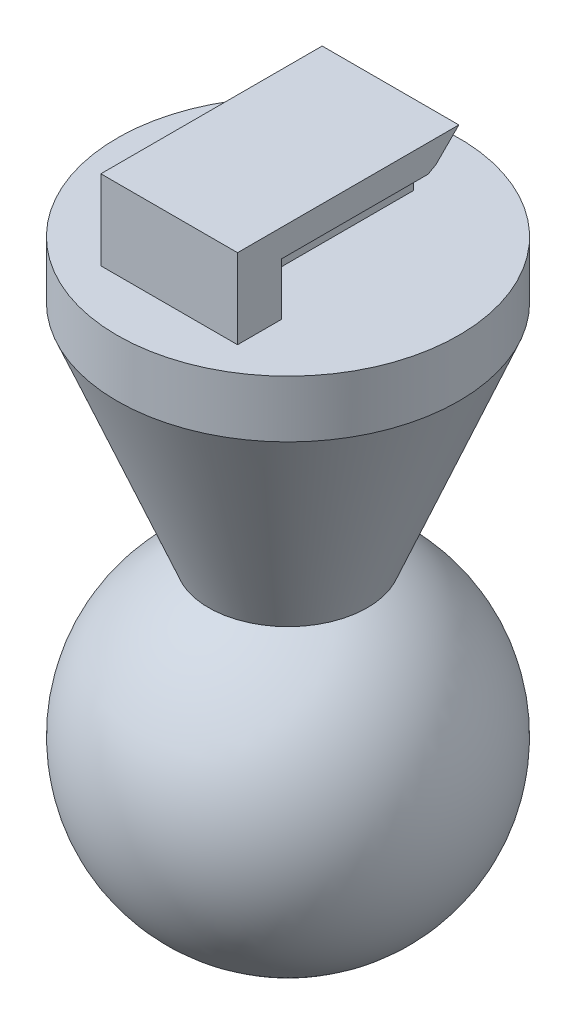
ISO-10303-21;
HEADER;
FILE_DESCRIPTION(('STEP AP214'),'2;1');
FILE_NAME('part.step','',(''),(''),'','','');
FILE_SCHEMA(('AUTOMOTIVE_DESIGN { 1 0 10303 214 1 1 1 1 }'));
ENDSEC;
DATA;
#1=APPLICATION_CONTEXT('core data for automotive mechanical design processes');
#2=APPLICATION_PROTOCOL_DEFINITION('international standard','automotive_design',2000,#1);
#3=PRODUCT_CONTEXT('',#1,'mechanical');
#4=PRODUCT('Part','Part','',(#3));
#5=PRODUCT_RELATED_PRODUCT_CATEGORY('part','',(#4));
#6=PRODUCT_DEFINITION_FORMATION('','',#4);
#7=PRODUCT_DEFINITION_CONTEXT('part definition',#1,'design');
#8=PRODUCT_DEFINITION('design','',#6,#7);
#9=PRODUCT_DEFINITION_SHAPE('','',#8);
#10=(LENGTH_UNIT() NAMED_UNIT(*) SI_UNIT(.MILLI.,.METRE.));
#11=(NAMED_UNIT(*) PLANE_ANGLE_UNIT() SI_UNIT($,.RADIAN.));
#12=(NAMED_UNIT(*) SI_UNIT($,.STERADIAN.) SOLID_ANGLE_UNIT());
#13=UNCERTAINTY_MEASURE_WITH_UNIT(LENGTH_MEASURE(1.E-05),#10,'distance_accuracy_value','');
#14=(GEOMETRIC_REPRESENTATION_CONTEXT(3) GLOBAL_UNCERTAINTY_ASSIGNED_CONTEXT((#13)) GLOBAL_UNIT_ASSIGNED_CONTEXT((#10,
#11,#12)) REPRESENTATION_CONTEXT('',''));
#15=CARTESIAN_POINT('',(0.,0.,0.));
#16=DIRECTION('',(0.,0.,1.));
#17=DIRECTION('',(1.,0.,0.));
#18=AXIS2_PLACEMENT_3D('',#15,#16,#17);
#19=CARTESIAN_POINT('',(0.,-2.,-4.5));
#20=DIRECTION('',(0.,1.,0.));
#21=DIRECTION('',(0.,0.,1.));
#22=AXIS2_PLACEMENT_3D('',#19,#20,#21);
#23=CYLINDRICAL_SURFACE('',#22,7.5);
#24=CARTESIAN_POINT('',(0.,-2.,-4.5));
#25=DIRECTION('',(0.,-1.,0.));
#26=DIRECTION('',(0.,0.,-1.));
#27=AXIS2_PLACEMENT_3D('',#24,#25,#26);
#28=CIRCLE('',#27,7.5);
#29=CARTESIAN_POINT('',(0.,-2.00000000000001,-12.));
#30=VERTEX_POINT('',#29);
#31=EDGE_CURVE('E187',#30,#30,#28,.T.);
#32=ORIENTED_EDGE('',*,*,#31,.F.);
#33=EDGE_LOOP('',(#32));
#34=FACE_BOUND('',#33,.T.);
#35=CARTESIAN_POINT('',(0.,0.499999999999997,-4.5));
#36=DIRECTION('',(0.,1.,0.));
#37=DIRECTION('',(0.,0.,1.));
#38=AXIS2_PLACEMENT_3D('',#35,#36,#37);
#39=CIRCLE('',#38,7.5);
#40=CARTESIAN_POINT('',(0.,0.500000000000002,3.));
#41=VERTEX_POINT('',#40);
#42=EDGE_CURVE('E140',#41,#41,#39,.T.);
#43=ORIENTED_EDGE('',*,*,#42,.F.);
#44=EDGE_LOOP('',(#43));
#45=FACE_BOUND('',#44,.T.);
#46=ADVANCED_FACE('F33',(#34,#45),#23,.T.);
#47=CARTESIAN_POINT('',(0.,-2.,-4.5));
#48=DIRECTION('',(0.,1.,0.));
#49=DIRECTION('',(0.,0.,1.));
#50=AXIS2_PLACEMENT_3D('',#47,#48,#49);
#51=CONICAL_SURFACE('',#50,7.5,0.386402431206859);
#52=CARTESIAN_POINT('',(0.,-11.8605308430168,-4.5));
#53=DIRECTION('',(0.,-1.,0.));
#54=DIRECTION('',(0.,0.,-1.));
#55=AXIS2_PLACEMENT_3D('',#52,#53,#54);
#56=CIRCLE('',#55,3.48818710987083);
#57=CARTESIAN_POINT('',(0.,-11.8605308430168,-7.98818710987083));
#58=VERTEX_POINT('',#57);
#59=EDGE_CURVE('E186',#58,#58,#56,.F.);
#60=ORIENTED_EDGE('',*,*,#59,.T.);
#61=EDGE_LOOP('',(#60));
#62=FACE_BOUND('',#61,.T.);
#63=ORIENTED_EDGE('',*,*,#31,.T.);
#64=EDGE_LOOP('',(#63));
#65=FACE_BOUND('',#64,.T.);
#66=ADVANCED_FACE('F266',(#62,#65),#51,.T.);
#67=CARTESIAN_POINT('',(0.,-18.5,-4.5));
#68=DIRECTION('',(0.,1.,0.));
#69=DIRECTION('',(0.,0.,-1.));
#70=AXIS2_PLACEMENT_3D('',#67,#68,#69);
#71=SPHERICAL_SURFACE('',#70,7.5);
#72=ORIENTED_EDGE('',*,*,#59,.F.);
#73=EDGE_LOOP('',(#72));
#74=FACE_BOUND('',#73,.T.);
#75=ADVANCED_FACE('F274',(#74),#71,.T.);
#76=CARTESIAN_POINT('',(0.,0.499999999999997,-4.5));
#77=DIRECTION('',(0.,1.,0.));
#78=DIRECTION('',(0.,0.,1.));
#79=AXIS2_PLACEMENT_3D('',#76,#77,#78);
#80=PLANE('',#79);
#81=ORIENTED_EDGE('',*,*,#42,.T.);
#82=EDGE_LOOP('',(#81));
#83=FACE_BOUND('',#82,.T.);
#84=DIRECTION('',(-1.,0.,0.));
#85=VECTOR('',#84,1.);
#86=CARTESIAN_POINT('',(1.,0.499999999999994,-9.));
#87=LINE('',#86,#85);
#88=CARTESIAN_POINT('',(1.,0.499999999999994,-9.));
#89=VERTEX_POINT('',#88);
#90=CARTESIAN_POINT('',(-1.,0.499999999999994,-9.));
#91=VERTEX_POINT('',#90);
#92=EDGE_CURVE('E146',#89,#91,#87,.T.);
#93=ORIENTED_EDGE('',*,*,#92,.F.);
#94=DIRECTION('',(0.,0.,-1.));
#95=VECTOR('',#94,1.);
#96=CARTESIAN_POINT('',(1.,0.5,0.));
#97=LINE('',#96,#95);
#98=CARTESIAN_POINT('',(1.,0.499999999999999,-1.20445497286554));
#99=VERTEX_POINT('',#98);
#100=EDGE_CURVE('E151',#99,#89,#97,.T.);
#101=ORIENTED_EDGE('',*,*,#100,.F.);
#102=DIRECTION('',(-1.,0.,0.));
#103=VECTOR('',#102,1.);
#104=CARTESIAN_POINT('',(10.6157731058639,0.499999999999999,-1.20445497286554));
#105=LINE('',#104,#103);
#106=CARTESIAN_POINT('',(3.,0.499999999999999,-1.20445497286554));
#107=VERTEX_POINT('',#106);
#108=EDGE_CURVE('E258',#107,#99,#105,.T.);
#109=ORIENTED_EDGE('',*,*,#108,.F.);
#110=DIRECTION('',(0.,0.,-1.));
#111=VECTOR('',#110,1.);
#112=CARTESIAN_POINT('',(3.,0.5,0.));
#113=LINE('',#112,#111);
#114=CARTESIAN_POINT('',(3.,0.5,0.714919666854875));
#115=VERTEX_POINT('',#114);
#116=EDGE_CURVE('E48',#115,#107,#113,.T.);
#117=ORIENTED_EDGE('',*,*,#116,.F.);
#118=DIRECTION('',(1.,0.,0.));
#119=VECTOR('',#118,1.);
#120=CARTESIAN_POINT('',(10.6157731058639,0.5,0.714919666854875));
#121=LINE('',#120,#119);
#122=CARTESIAN_POINT('',(-3.,0.5,0.714919666854875));
#123=VERTEX_POINT('',#122);
#124=EDGE_CURVE('E11',#123,#115,#121,.T.);
#125=ORIENTED_EDGE('',*,*,#124,.F.);
#126=DIRECTION('',(0.,0.,-1.));
#127=VECTOR('',#126,1.);
#128=CARTESIAN_POINT('',(-3.,0.5,0.));
#129=LINE('',#128,#127);
#130=CARTESIAN_POINT('',(-3.,0.499999999999999,-1.20445497286554));
#131=VERTEX_POINT('',#130);
#132=EDGE_CURVE('E127',#123,#131,#129,.T.);
#133=ORIENTED_EDGE('',*,*,#132,.T.);
#134=DIRECTION('',(-1.,0.,0.));
#135=VECTOR('',#134,1.);
#136=CARTESIAN_POINT('',(10.6157731058639,0.499999999999999,-1.20445497286554));
#137=LINE('',#136,#135);
#138=CARTESIAN_POINT('',(-1.,0.499999999999999,-1.20445497286554));
#139=VERTEX_POINT('',#138);
#140=EDGE_CURVE('E254',#139,#131,#137,.T.);
#141=ORIENTED_EDGE('',*,*,#140,.F.);
#142=DIRECTION('',(0.,0.,-1.));
#143=VECTOR('',#142,1.);
#144=CARTESIAN_POINT('',(-1.,0.5,0.));
#145=LINE('',#144,#143);
#146=EDGE_CURVE('E253',#139,#91,#145,.T.);
#147=ORIENTED_EDGE('',*,*,#146,.T.);
#148=EDGE_LOOP('',(#93,#101,#109,#117,#125,#133,#141,#147));
#149=FACE_BOUND('',#148,.T.);
#150=ADVANCED_FACE('F126',(#83,#149),#80,.T.);
#151=CARTESIAN_POINT('',(3.,4.,-9.));
#152=DIRECTION('',(0.,0.707106781186551,0.707106781186544));
#153=DIRECTION('',(0.,-0.707106781186544,0.707106781186551));
#154=AXIS2_PLACEMENT_3D('',#151,#152,#153);
#155=PLANE('',#154);
#156=DIRECTION('',(0.,-0.707106781186544,0.707106781186551));
#157=VECTOR('',#156,1.);
#158=CARTESIAN_POINT('',(1.,4.,-9.));
#159=LINE('',#158,#157);
#160=CARTESIAN_POINT('',(1.,4.,-9.));
#161=VERTEX_POINT('',#160);
#162=CARTESIAN_POINT('',(1.,3.,-7.99999999999999));
#163=VERTEX_POINT('',#162);
#164=EDGE_CURVE('E200',#161,#163,#159,.T.);
#165=ORIENTED_EDGE('',*,*,#164,.F.);
#166=DIRECTION('',(-1.,0.,0.));
#167=VECTOR('',#166,1.);
#168=CARTESIAN_POINT('',(3.,4.,-9.));
#169=LINE('',#168,#167);
#170=CARTESIAN_POINT('',(3.,4.,-9.));
#171=VERTEX_POINT('',#170);
#172=EDGE_CURVE('E213',#171,#161,#169,.T.);
#173=ORIENTED_EDGE('',*,*,#172,.F.);
#174=DIRECTION('',(0.,0.707106781186544,-0.707106781186551));
#175=VECTOR('',#174,1.);
#176=CARTESIAN_POINT('',(3.,4.,-9.));
#177=LINE('',#176,#175);
#178=CARTESIAN_POINT('',(3.,3.,-7.99999999999999));
#179=VERTEX_POINT('',#178);
#180=EDGE_CURVE('E203',#179,#171,#177,.T.);
#181=ORIENTED_EDGE('',*,*,#180,.F.);
#182=DIRECTION('',(-1.,0.,0.));
#183=VECTOR('',#182,1.);
#184=CARTESIAN_POINT('',(3.,3.,-7.99999999999999));
#185=LINE('',#184,#183);
#186=EDGE_CURVE('E217',#179,#163,#185,.T.);
#187=ORIENTED_EDGE('',*,*,#186,.T.);
#188=EDGE_LOOP('',(#165,#173,#181,#187));
#189=FACE_BOUND('',#188,.T.);
#190=ADVANCED_FACE('F247',(#189),#155,.F.);
#191=CARTESIAN_POINT('',(10.6157731058639,3.,-7.99999999999999));
#192=DIRECTION('',(0.,0.866357373985093,0.499424569421304));
#193=DIRECTION('',(0.,-0.499424569421304,0.866357373985093));
#194=AXIS2_PLACEMENT_3D('',#191,#192,#193);
#195=PLANE('',#194);
#196=DIRECTION('',(-1.,0.,0.));
#197=VECTOR('',#196,1.);
#198=CARTESIAN_POINT('',(10.6157731058639,2.8,-7.65305776806736));
#199=LINE('',#198,#197);
#200=CARTESIAN_POINT('',(3.,2.8,-7.65305776806736));
#201=VERTEX_POINT('',#200);
#202=CARTESIAN_POINT('',(1.,2.8,-7.65305776806736));
#203=VERTEX_POINT('',#202);
#204=EDGE_CURVE('E171',#201,#203,#199,.T.);
#205=ORIENTED_EDGE('',*,*,#204,.T.);
#206=DIRECTION('',(0.,0.499424569421304,-0.866357373985093));
#207=VECTOR('',#206,1.);
#208=CARTESIAN_POINT('',(1.,-1.20971596936477,-0.697358728930805));
#209=LINE('',#208,#207);
#210=EDGE_CURVE('E55',#203,#163,#209,.T.);
#211=ORIENTED_EDGE('',*,*,#210,.T.);
#212=ORIENTED_EDGE('',*,*,#186,.F.);
#213=DIRECTION('',(0.,-0.499424569421304,0.866357373985093));
#214=VECTOR('',#213,1.);
#215=CARTESIAN_POINT('',(3.,3.,-7.99999999999999));
#216=LINE('',#215,#214);
#217=EDGE_CURVE('E167',#179,#201,#216,.T.);
#218=ORIENTED_EDGE('',*,*,#217,.T.);
#219=EDGE_LOOP('',(#205,#211,#212,#218));
#220=FACE_BOUND('',#219,.T.);
#221=ADVANCED_FACE('F326',(#220),#195,.F.);
#222=DIRECTION('',(0.,0.499424569421304,-0.866357373985093));
#223=VECTOR('',#222,1.);
#224=CARTESIAN_POINT('',(-1.,-1.20971596936477,-0.697358728930805));
#225=LINE('',#224,#223);
#226=CARTESIAN_POINT('',(-1.,2.8,-7.65305776806736));
#227=VERTEX_POINT('',#226);
#228=CARTESIAN_POINT('',(-1.,3.,-7.99999999999999));
#229=VERTEX_POINT('',#228);
#230=EDGE_CURVE('E41',#227,#229,#225,.T.);
#231=ORIENTED_EDGE('',*,*,#230,.F.);
#232=CARTESIAN_POINT('',(-3.,2.8,-7.65305776806736));
#233=VERTEX_POINT('',#232);
#234=EDGE_CURVE('E162',#227,#233,#199,.T.);
#235=ORIENTED_EDGE('',*,*,#234,.T.);
#236=DIRECTION('',(0.,0.499424569421304,-0.866357373985092));
#237=VECTOR('',#236,1.);
#238=CARTESIAN_POINT('',(-3.,3.,-7.99999999999999));
#239=LINE('',#238,#237);
#240=CARTESIAN_POINT('',(-3.,3.,-7.99999999999999));
#241=VERTEX_POINT('',#240);
#242=EDGE_CURVE('E160',#233,#241,#239,.T.);
#243=ORIENTED_EDGE('',*,*,#242,.T.);
#244=EDGE_CURVE('E216',#229,#241,#185,.T.);
#245=ORIENTED_EDGE('',*,*,#244,.F.);
#246=EDGE_LOOP('',(#231,#235,#243,#245));
#247=FACE_BOUND('',#246,.T.);
#248=ADVANCED_FACE('F310',(#247),#195,.F.);
#249=CARTESIAN_POINT('',(-1.,4.,-9.));
#250=VERTEX_POINT('',#249);
#251=CARTESIAN_POINT('',(-3.,4.,-9.));
#252=VERTEX_POINT('',#251);
#253=EDGE_CURVE('E209',#250,#252,#169,.T.);
#254=ORIENTED_EDGE('',*,*,#253,.F.);
#255=DIRECTION('',(0.,-0.707106781186544,0.707106781186551));
#256=VECTOR('',#255,1.);
#257=CARTESIAN_POINT('',(-1.,4.,-9.));
#258=LINE('',#257,#256);
#259=EDGE_CURVE('E197',#250,#229,#258,.T.);
#260=ORIENTED_EDGE('',*,*,#259,.T.);
#261=ORIENTED_EDGE('',*,*,#244,.T.);
#262=DIRECTION('',(0.,0.707106781186544,-0.707106781186551));
#263=VECTOR('',#262,1.);
#264=CARTESIAN_POINT('',(-3.,4.,-9.));
#265=LINE('',#264,#263);
#266=EDGE_CURVE('E202',#241,#252,#265,.T.);
#267=ORIENTED_EDGE('',*,*,#266,.T.);
#268=EDGE_LOOP('',(#254,#260,#261,#267));
#269=FACE_BOUND('',#268,.T.);
#270=ADVANCED_FACE('F35',(#269),#155,.F.);
#271=CARTESIAN_POINT('',(10.6157731058639,2.8,-7.65305776806736));
#272=DIRECTION('',(0.,1.,0.));
#273=DIRECTION('',(0.,0.,1.));
#274=AXIS2_PLACEMENT_3D('',#271,#272,#273);
#275=PLANE('',#274);
#276=DIRECTION('',(0.,0.,-1.));
#277=VECTOR('',#276,1.);
#278=CARTESIAN_POINT('',(-1.,2.8,0.));
#279=LINE('',#278,#277);
#280=CARTESIAN_POINT('',(-1.,2.8,-1.20445497286554));
#281=VERTEX_POINT('',#280);
#282=EDGE_CURVE('E220',#281,#227,#279,.T.);
#283=ORIENTED_EDGE('',*,*,#282,.F.);
#284=DIRECTION('',(-1.,0.,0.));
#285=VECTOR('',#284,1.);
#286=CARTESIAN_POINT('',(10.6157731058639,2.8,-1.20445497286554));
#287=LINE('',#286,#285);
#288=CARTESIAN_POINT('',(-3.,2.8,-1.20445497286554));
#289=VERTEX_POINT('',#288);
#290=EDGE_CURVE('E174',#281,#289,#287,.T.);
#291=ORIENTED_EDGE('',*,*,#290,.T.);
#292=DIRECTION('',(0.,0.,-1.));
#293=VECTOR('',#292,1.);
#294=CARTESIAN_POINT('',(-3.,2.8,-7.65305776806736));
#295=LINE('',#294,#293);
#296=EDGE_CURVE('E157',#289,#233,#295,.T.);
#297=ORIENTED_EDGE('',*,*,#296,.T.);
#298=ORIENTED_EDGE('',*,*,#234,.F.);
#299=EDGE_LOOP('',(#283,#291,#297,#298));
#300=FACE_BOUND('',#299,.T.);
#301=ADVANCED_FACE('F299',(#300),#275,.F.);
#302=CARTESIAN_POINT('',(3.,2.8,-1.20445497286554));
#303=VERTEX_POINT('',#302);
#304=CARTESIAN_POINT('',(1.,2.8,-1.20445497286554));
#305=VERTEX_POINT('',#304);
#306=EDGE_CURVE('E175',#303,#305,#287,.T.);
#307=ORIENTED_EDGE('',*,*,#306,.T.);
#308=DIRECTION('',(0.,0.,-1.));
#309=VECTOR('',#308,1.);
#310=CARTESIAN_POINT('',(1.,2.8,0.));
#311=LINE('',#310,#309);
#312=EDGE_CURVE('E183',#305,#203,#311,.T.);
#313=ORIENTED_EDGE('',*,*,#312,.T.);
#314=ORIENTED_EDGE('',*,*,#204,.F.);
#315=DIRECTION('',(0.,0.,1.));
#316=VECTOR('',#315,1.);
#317=CARTESIAN_POINT('',(3.,2.8,-7.65305776806736));
#318=LINE('',#317,#316);
#319=EDGE_CURVE('E163',#201,#303,#318,.T.);
#320=ORIENTED_EDGE('',*,*,#319,.T.);
#321=EDGE_LOOP('',(#307,#313,#314,#320));
#322=FACE_BOUND('',#321,.T.);
#323=ADVANCED_FACE('F293',(#322),#275,.F.);
#324=CARTESIAN_POINT('',(3.,4.,0.));
#325=DIRECTION('',(0.,-1.,0.));
#326=DIRECTION('',(0.,0.,-1.));
#327=AXIS2_PLACEMENT_3D('',#324,#325,#326);
#328=PLANE('',#327);
#329=DIRECTION('',(0.,0.,1.));
#330=VECTOR('',#329,1.);
#331=CARTESIAN_POINT('',(-3.,4.,0.));
#332=LINE('',#331,#330);
#333=CARTESIAN_POINT('',(-3.,4.,0.714919666854875));
#334=VERTEX_POINT('',#333);
#335=EDGE_CURVE('E206',#252,#334,#332,.T.);
#336=ORIENTED_EDGE('',*,*,#335,.T.);
#337=DIRECTION('',(-1.,0.,0.));
#338=VECTOR('',#337,1.);
#339=CARTESIAN_POINT('',(10.6157731058639,4.,0.714919666854875));
#340=LINE('',#339,#338);
#341=CARTESIAN_POINT('',(3.,4.,0.714919666854875));
#342=VERTEX_POINT('',#341);
#343=EDGE_CURVE('E145',#342,#334,#340,.T.);
#344=ORIENTED_EDGE('',*,*,#343,.F.);
#345=DIRECTION('',(0.,0.,1.));
#346=VECTOR('',#345,1.);
#347=CARTESIAN_POINT('',(3.,4.,0.));
#348=LINE('',#347,#346);
#349=EDGE_CURVE('E205',#171,#342,#348,.T.);
#350=ORIENTED_EDGE('',*,*,#349,.F.);
#351=ORIENTED_EDGE('',*,*,#172,.T.);
#352=DIRECTION('',(-1.,0.,0.));
#353=VECTOR('',#352,1.);
#354=CARTESIAN_POINT('',(1.,4.,-9.));
#355=LINE('',#354,#353);
#356=EDGE_CURVE('E193',#161,#250,#355,.T.);
#357=ORIENTED_EDGE('',*,*,#356,.T.);
#358=ORIENTED_EDGE('',*,*,#253,.T.);
#359=EDGE_LOOP('',(#336,#344,#350,#351,#357,#358));
#360=FACE_BOUND('',#359,.T.);
#361=ADVANCED_FACE('F239',(#360),#328,.F.);
#362=CARTESIAN_POINT('',(1.,4.,-9.));
#363=DIRECTION('',(0.,0.,1.));
#364=DIRECTION('',(1.,0.,0.));
#365=AXIS2_PLACEMENT_3D('',#362,#363,#364);
#366=PLANE('',#365);
#367=DIRECTION('',(0.,1.,0.));
#368=VECTOR('',#367,1.);
#369=CARTESIAN_POINT('',(1.,4.,-9.));
#370=LINE('',#369,#368);
#371=EDGE_CURVE('E191',#89,#161,#370,.T.);
#372=ORIENTED_EDGE('',*,*,#371,.F.);
#373=ORIENTED_EDGE('',*,*,#92,.T.);
#374=DIRECTION('',(0.,1.,0.));
#375=VECTOR('',#374,1.);
#376=CARTESIAN_POINT('',(-1.,4.,-9.));
#377=LINE('',#376,#375);
#378=EDGE_CURVE('E190',#91,#250,#377,.T.);
#379=ORIENTED_EDGE('',*,*,#378,.T.);
#380=ORIENTED_EDGE('',*,*,#356,.F.);
#381=EDGE_LOOP('',(#372,#373,#379,#380));
#382=FACE_BOUND('',#381,.T.);
#383=ADVANCED_FACE('F245',(#382),#366,.F.);
#384=CARTESIAN_POINT('',(10.6157731058639,2.8,-1.20445497286554));
#385=DIRECTION('',(0.,0.,1.));
#386=DIRECTION('',(0.,-1.,0.));
#387=AXIS2_PLACEMENT_3D('',#384,#385,#386);
#388=PLANE('',#387);
#389=DIRECTION('',(0.,-1.,0.));
#390=VECTOR('',#389,1.);
#391=CARTESIAN_POINT('',(3.,2.8,-1.20445497286554));
#392=LINE('',#391,#390);
#393=EDGE_CURVE('E166',#303,#107,#392,.T.);
#394=ORIENTED_EDGE('',*,*,#393,.T.);
#395=ORIENTED_EDGE('',*,*,#108,.T.);
#396=DIRECTION('',(0.,1.,0.));
#397=VECTOR('',#396,1.);
#398=CARTESIAN_POINT('',(1.,0.,-1.20445497286554));
#399=LINE('',#398,#397);
#400=EDGE_CURVE('E181',#99,#305,#399,.T.);
#401=ORIENTED_EDGE('',*,*,#400,.T.);
#402=ORIENTED_EDGE('',*,*,#306,.F.);
#403=EDGE_LOOP('',(#394,#395,#401,#402));
#404=FACE_BOUND('',#403,.T.);
#405=ADVANCED_FACE('F287',(#404),#388,.F.);
#406=DIRECTION('',(0.,1.,0.));
#407=VECTOR('',#406,1.);
#408=CARTESIAN_POINT('',(-1.,0.,-1.20445497286554));
#409=LINE('',#408,#407);
#410=EDGE_CURVE('E170',#139,#281,#409,.T.);
#411=ORIENTED_EDGE('',*,*,#410,.F.);
#412=ORIENTED_EDGE('',*,*,#140,.T.);
#413=DIRECTION('',(0.,1.,0.));
#414=VECTOR('',#413,1.);
#415=CARTESIAN_POINT('',(-3.,2.8,-1.20445497286554));
#416=LINE('',#415,#414);
#417=EDGE_CURVE('E139',#131,#289,#416,.T.);
#418=ORIENTED_EDGE('',*,*,#417,.T.);
#419=ORIENTED_EDGE('',*,*,#290,.F.);
#420=EDGE_LOOP('',(#411,#412,#418,#419));
#421=FACE_BOUND('',#420,.T.);
#422=ADVANCED_FACE('F312',(#421),#388,.F.);
#423=CARTESIAN_POINT('',(10.6157731058639,4.,0.714919666854875));
#424=DIRECTION('',(0.,0.,-1.));
#425=DIRECTION('',(-1.,0.,0.));
#426=AXIS2_PLACEMENT_3D('',#423,#424,#425);
#427=PLANE('',#426);
#428=DIRECTION('',(0.,-1.,0.));
#429=VECTOR('',#428,1.);
#430=CARTESIAN_POINT('',(-3.,4.,0.714919666854875));
#431=LINE('',#430,#429);
#432=EDGE_CURVE('E137',#334,#123,#431,.T.);
#433=ORIENTED_EDGE('',*,*,#432,.T.);
#434=ORIENTED_EDGE('',*,*,#124,.T.);
#435=DIRECTION('',(0.,1.,0.));
#436=VECTOR('',#435,1.);
#437=CARTESIAN_POINT('',(3.,4.,0.714919666854875));
#438=LINE('',#437,#436);
#439=EDGE_CURVE('E148',#115,#342,#438,.T.);
#440=ORIENTED_EDGE('',*,*,#439,.T.);
#441=ORIENTED_EDGE('',*,*,#343,.T.);
#442=EDGE_LOOP('',(#433,#434,#440,#441));
#443=FACE_BOUND('',#442,.T.);
#444=ADVANCED_FACE('F143',(#443),#427,.F.);
#445=CARTESIAN_POINT('',(-3.,0.,0.));
#446=DIRECTION('',(-1.,0.,0.));
#447=DIRECTION('',(0.,0.,1.));
#448=AXIS2_PLACEMENT_3D('',#445,#446,#447);
#449=PLANE('',#448);
#450=ORIENTED_EDGE('',*,*,#132,.F.);
#451=ORIENTED_EDGE('',*,*,#432,.F.);
#452=ORIENTED_EDGE('',*,*,#335,.F.);
#453=ORIENTED_EDGE('',*,*,#266,.F.);
#454=ORIENTED_EDGE('',*,*,#242,.F.);
#455=ORIENTED_EDGE('',*,*,#296,.F.);
#456=ORIENTED_EDGE('',*,*,#417,.F.);
#457=EDGE_LOOP('',(#450,#451,#452,#453,#454,#455,#456));
#458=FACE_BOUND('',#457,.T.);
#459=ADVANCED_FACE('F135',(#458),#449,.T.);
#460=CARTESIAN_POINT('',(3.,0.,0.));
#461=DIRECTION('',(-1.,0.,0.));
#462=DIRECTION('',(0.,0.,1.));
#463=AXIS2_PLACEMENT_3D('',#460,#461,#462);
#464=PLANE('',#463);
#465=ORIENTED_EDGE('',*,*,#439,.F.);
#466=ORIENTED_EDGE('',*,*,#116,.T.);
#467=ORIENTED_EDGE('',*,*,#393,.F.);
#468=ORIENTED_EDGE('',*,*,#319,.F.);
#469=ORIENTED_EDGE('',*,*,#217,.F.);
#470=ORIENTED_EDGE('',*,*,#180,.T.);
#471=ORIENTED_EDGE('',*,*,#349,.T.);
#472=EDGE_LOOP('',(#465,#466,#467,#468,#469,#470,#471));
#473=FACE_BOUND('',#472,.T.);
#474=ADVANCED_FACE('F284',(#473),#464,.F.);
#475=CARTESIAN_POINT('',(-1.,0.,0.));
#476=DIRECTION('',(-1.,0.,0.));
#477=DIRECTION('',(0.,0.,1.));
#478=AXIS2_PLACEMENT_3D('',#475,#476,#477);
#479=PLANE('',#478);
#480=ORIENTED_EDGE('',*,*,#146,.F.);
#481=ORIENTED_EDGE('',*,*,#410,.T.);
#482=ORIENTED_EDGE('',*,*,#282,.T.);
#483=ORIENTED_EDGE('',*,*,#230,.T.);
#484=ORIENTED_EDGE('',*,*,#259,.F.);
#485=ORIENTED_EDGE('',*,*,#378,.F.);
#486=EDGE_LOOP('',(#480,#481,#482,#483,#484,#485));
#487=FACE_BOUND('',#486,.T.);
#488=ADVANCED_FACE('F228',(#487),#479,.T.);
#489=CARTESIAN_POINT('',(1.,0.,0.));
#490=DIRECTION('',(-1.,0.,0.));
#491=DIRECTION('',(0.,0.,1.));
#492=AXIS2_PLACEMENT_3D('',#489,#490,#491);
#493=PLANE('',#492);
#494=ORIENTED_EDGE('',*,*,#400,.F.);
#495=ORIENTED_EDGE('',*,*,#100,.T.);
#496=ORIENTED_EDGE('',*,*,#371,.T.);
#497=ORIENTED_EDGE('',*,*,#164,.T.);
#498=ORIENTED_EDGE('',*,*,#210,.F.);
#499=ORIENTED_EDGE('',*,*,#312,.F.);
#500=EDGE_LOOP('',(#494,#495,#496,#497,#498,#499));
#501=FACE_BOUND('',#500,.T.);
#502=ADVANCED_FACE('F250',(#501),#493,.F.);
#503=CLOSED_SHELL('',(#46,#66,#75,#150,#190,#221,#248,#270,#301,#323,#361,#383,#405,#422,#444,
#459,#474,#488,#502));
#504=MANIFOLD_SOLID_BREP('B2',#503);
#505=ADVANCED_BREP_SHAPE_REPRESENTATION('',(#18,#504),#14);
#506=SHAPE_DEFINITION_REPRESENTATION(#9,#505);
ENDSEC;
END-ISO-10303-21;
